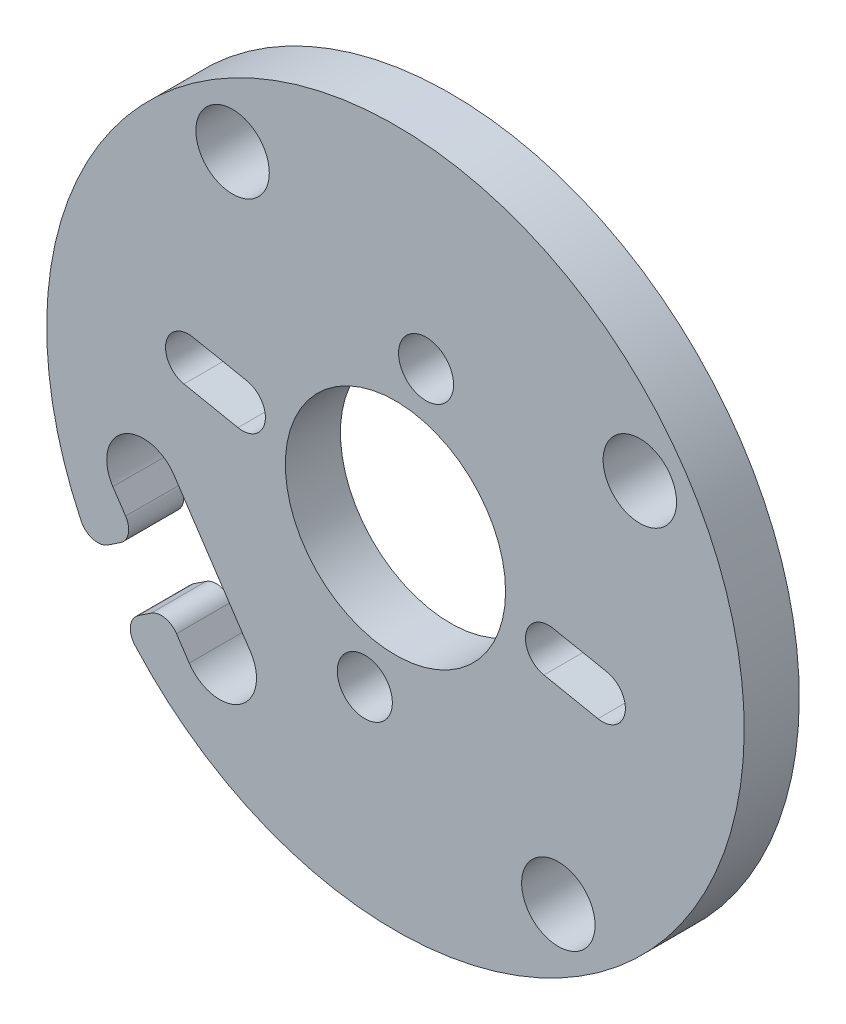
ISO-10303-21;
HEADER;
FILE_DESCRIPTION(('STEP AP214'),'2;1');
FILE_NAME('part.step','',(''),(''),'','','');
FILE_SCHEMA(('AUTOMOTIVE_DESIGN { 1 0 10303 214 1 1 1 1 }'));
ENDSEC;
DATA;
#1=APPLICATION_CONTEXT('core data for automotive mechanical design processes');
#2=APPLICATION_PROTOCOL_DEFINITION('international standard','automotive_design',2000,#1);
#3=PRODUCT_CONTEXT('',#1,'mechanical');
#4=PRODUCT('Part','Part','',(#3));
#5=PRODUCT_RELATED_PRODUCT_CATEGORY('part','',(#4));
#6=PRODUCT_DEFINITION_FORMATION('','',#4);
#7=PRODUCT_DEFINITION_CONTEXT('part definition',#1,'design');
#8=PRODUCT_DEFINITION('design','',#6,#7);
#9=PRODUCT_DEFINITION_SHAPE('','',#8);
#10=(LENGTH_UNIT() NAMED_UNIT(*) SI_UNIT(.MILLI.,.METRE.));
#11=(NAMED_UNIT(*) PLANE_ANGLE_UNIT() SI_UNIT($,.RADIAN.));
#12=(NAMED_UNIT(*) SI_UNIT($,.STERADIAN.) SOLID_ANGLE_UNIT());
#13=UNCERTAINTY_MEASURE_WITH_UNIT(LENGTH_MEASURE(1.E-05),#10,'distance_accuracy_value','');
#14=(GEOMETRIC_REPRESENTATION_CONTEXT(3) GLOBAL_UNCERTAINTY_ASSIGNED_CONTEXT((#13)) GLOBAL_UNIT_ASSIGNED_CONTEXT((#10,
#11,#12)) REPRESENTATION_CONTEXT('',''));
#15=CARTESIAN_POINT('',(0.,0.,0.));
#16=DIRECTION('',(0.,0.,1.));
#17=DIRECTION('',(1.,0.,0.));
#18=AXIS2_PLACEMENT_3D('',#15,#16,#17);
#19=CARTESIAN_POINT('',(-13.7294038679801,-4.64391746587856,3.));
#20=DIRECTION('',(0.,0.,1.));
#21=DIRECTION('',(1.,0.,0.));
#22=AXIS2_PLACEMENT_3D('',#19,#20,#21);
#23=PLANE('',#22);
#24=DIRECTION('',(0.980556431696109,-0.196237316174562,0.));
#25=VECTOR('',#24,1.);
#26=CARTESIAN_POINT('',(-11.5216956097235,1.03103359638733,3.));
#27=LINE('',#26,#25);
#28=CARTESIAN_POINT('',(-11.5216956097235,1.03103359638733,3.));
#29=VERTEX_POINT('',#28);
#30=CARTESIAN_POINT('',(-8.58002631463512,0.442321647863641,3.));
#31=VERTEX_POINT('',#30);
#32=EDGE_CURVE('E207',#29,#31,#27,.T.);
#33=ORIENTED_EDGE('',*,*,#32,.F.);
#34=CARTESIAN_POINT('',(-11.2763989645052,2.25672913600746,3.));
#35=DIRECTION('',(0.,0.,1.));
#36=DIRECTION('',(1.,0.,0.));
#37=AXIS2_PLACEMENT_3D('',#34,#35,#36);
#38=CIRCLE('',#37,1.25);
#39=CARTESIAN_POINT('',(-11.031102319287,3.4824246756276,3.));
#40=VERTEX_POINT('',#39);
#41=EDGE_CURVE('E205',#40,#29,#38,.T.);
#42=ORIENTED_EDGE('',*,*,#41,.F.);
#43=DIRECTION('',(-0.980556431696109,0.196237316174562,0.));
#44=VECTOR('',#43,1.);
#45=CARTESIAN_POINT('',(-11.031102319287,3.4824246756276,3.));
#46=LINE('',#45,#44);
#47=CARTESIAN_POINT('',(-8.08943302419872,2.89371272710391,3.));
#48=VERTEX_POINT('',#47);
#49=EDGE_CURVE('E213',#48,#40,#46,.T.);
#50=ORIENTED_EDGE('',*,*,#49,.F.);
#51=CARTESIAN_POINT('',(-8.33472966941692,1.66801718748378,3.));
#52=DIRECTION('',(0.,0.,1.));
#53=DIRECTION('',(1.,0.,0.));
#54=AXIS2_PLACEMENT_3D('',#51,#52,#53);
#55=CIRCLE('',#54,1.25);
#56=EDGE_CURVE('E210',#31,#48,#55,.T.);
#57=ORIENTED_EDGE('',*,*,#56,.F.);
#58=EDGE_LOOP('',(#33,#42,#50,#57));
#59=FACE_BOUND('',#58,.T.);
#60=CARTESIAN_POINT('',(8.87355781395305,-13.3139013829657,3.));
#61=DIRECTION('',(0.,0.,1.));
#62=DIRECTION('',(1.,0.,0.));
#63=AXIS2_PLACEMENT_3D('',#60,#61,#62);
#64=CIRCLE('',#63,2.);
#65=CARTESIAN_POINT('',(10.8735578139531,-13.3139013829657,3.));
#66=VERTEX_POINT('',#65);
#67=EDGE_CURVE('E242',#66,#66,#64,.T.);
#68=ORIENTED_EDGE('',*,*,#67,.F.);
#69=EDGE_LOOP('',(#68));
#70=FACE_BOUND('',#69,.T.);
#71=CARTESIAN_POINT('',(1.66801718748375,8.33472966941693,3.));
#72=DIRECTION('',(0.,0.,1.));
#73=DIRECTION('',(1.,0.,0.));
#74=AXIS2_PLACEMENT_3D('',#71,#72,#73);
#75=CIRCLE('',#74,1.5);
#76=CARTESIAN_POINT('',(3.16801718748375,8.33472966941693,3.));
#77=VERTEX_POINT('',#76);
#78=EDGE_CURVE('E254',#77,#77,#75,.T.);
#79=ORIENTED_EDGE('',*,*,#78,.F.);
#80=EDGE_LOOP('',(#79));
#81=FACE_BOUND('',#80,.T.);
#82=CARTESIAN_POINT('',(-8.8735578431924,13.3139014268365,3.));
#83=DIRECTION('',(0.,0.,1.));
#84=DIRECTION('',(1.,0.,0.));
#85=AXIS2_PLACEMENT_3D('',#82,#83,#84);
#86=CIRCLE('',#85,2.);
#87=CARTESIAN_POINT('',(-6.87355784319241,13.3139014268365,3.));
#88=VERTEX_POINT('',#87);
#89=EDGE_CURVE('E266',#88,#88,#86,.T.);
#90=ORIENTED_EDGE('',*,*,#89,.F.);
#91=EDGE_LOOP('',(#90));
#92=FACE_BOUND('',#91,.T.);
#93=CARTESIAN_POINT('',(-13.7294038679801,-4.64391746587856,3.));
#94=DIRECTION('',(0.,0.,-1.));
#95=DIRECTION('',(1.,0.,0.));
#96=AXIS2_PLACEMENT_3D('',#93,#94,#95);
#97=CIRCLE('',#96,2.);
#98=CARTESIAN_POINT('',(-15.3936415463347,-5.7531121962776,3.));
#99=VERTEX_POINT('',#98);
#100=CARTESIAN_POINT('',(-12.0651661896256,-3.5347227354795,3.));
#101=VERTEX_POINT('',#100);
#102=EDGE_CURVE('E272',#99,#101,#97,.T.);
#103=ORIENTED_EDGE('',*,*,#102,.T.);
#104=DIRECTION('',(0.554597365199526,-0.83211883917728,0.));
#105=VECTOR('',#104,1.);
#106=CARTESIAN_POINT('',(-12.0651661896256,-3.5347227354795,3.));
#107=LINE('',#106,#105);
#108=CARTESIAN_POINT('',(-7.90568595062914,-9.77561402930911,3.));
#109=VERTEX_POINT('',#108);
#110=EDGE_CURVE('E275',#101,#109,#107,.T.);
#111=ORIENTED_EDGE('',*,*,#110,.T.);
#112=CARTESIAN_POINT('',(-9.5699236289837,-10.8848087597082,3.));
#113=DIRECTION('',(0.,0.,-1.));
#114=DIRECTION('',(1.,0.,0.));
#115=AXIS2_PLACEMENT_3D('',#112,#113,#114);
#116=CIRCLE('',#115,2.);
#117=CARTESIAN_POINT('',(-11.2341613073383,-11.9940034901072,3.));
#118=VERTEX_POINT('',#117);
#119=EDGE_CURVE('E278',#109,#118,#116,.T.);
#120=ORIENTED_EDGE('',*,*,#119,.T.);
#121=DIRECTION('',(-0.554597365199527,0.832118839177279,0.));
#122=VECTOR('',#121,1.);
#123=CARTESIAN_POINT('',(-11.9274080138377,-10.9538549411356,3.));
#124=LINE('',#123,#122);
#125=CARTESIAN_POINT('',(-11.9274080138377,-10.9538549411356,3.));
#126=VERTEX_POINT('',#125);
#127=EDGE_CURVE('E280',#118,#126,#124,.T.);
#128=ORIENTED_EDGE('',*,*,#127,.T.);
#129=CARTESIAN_POINT('',(-12.7595268530149,-11.5084523063351,3.));
#130=DIRECTION('',(0.,0.,1.));
#131=DIRECTION('',(1.,0.,0.));
#132=AXIS2_PLACEMENT_3D('',#129,#130,#131);
#133=CIRCLE('',#132,1.);
#134=CARTESIAN_POINT('',(-13.3141242182145,-10.6763334671579,3.));
#135=VERTEX_POINT('',#134);
#136=EDGE_CURVE('E282',#126,#135,#133,.T.);
#137=ORIENTED_EDGE('',*,*,#136,.T.);
#138=DIRECTION('',(-0.83211883917728,-0.554597365199525,0.));
#139=VECTOR('',#138,1.);
#140=CARTESIAN_POINT('',(-14.0010744921412,-11.1341777004641,3.));
#141=LINE('',#140,#139);
#142=CARTESIAN_POINT('',(-14.0010744921412,-11.1341777004641,3.));
#143=VERTEX_POINT('',#142);
#144=EDGE_CURVE('E284',#135,#143,#141,.T.);
#145=ORIENTED_EDGE('',*,*,#144,.T.);
#146=CARTESIAN_POINT('',(-13.4464771269417,-11.9662965396414,3.));
#147=DIRECTION('',(0.,0.,1.));
#148=DIRECTION('',(-1.,0.,0.));
#149=AXIS2_PLACEMENT_3D('',#146,#147,#148);
#150=CIRCLE('',#149,1.);
#151=CARTESIAN_POINT('',(-14.193503633994,-12.6310907918437,3.));
#152=VERTEX_POINT('',#151);
#153=EDGE_CURVE('E286',#143,#152,#150,.T.);
#154=ORIENTED_EDGE('',*,*,#153,.T.);
#155=CARTESIAN_POINT('',(0.,0.,3.));
#156=DIRECTION('',(0.,0.,1.));
#157=DIRECTION('',(1.,0.,0.));
#158=AXIS2_PLACEMENT_3D('',#155,#156,#157);
#159=CIRCLE('',#158,19.);
#160=CARTESIAN_POINT('',(-17.1205452836581,-8.23935247396365,3.));
#161=VERTEX_POINT('',#160);
#162=EDGE_CURVE('E288',#152,#161,#159,.T.);
#163=ORIENTED_EDGE('',*,*,#162,.T.);
#164=CARTESIAN_POINT('',(-16.2194639529393,-7.80570234375503,3.));
#165=DIRECTION('',(0.,0.,1.));
#166=DIRECTION('',(1.,0.,0.));
#167=AXIS2_PLACEMENT_3D('',#164,#165,#166);
#168=CIRCLE('',#167,1.);
#169=CARTESIAN_POINT('',(-15.6648665877398,-8.63782118293231,3.));
#170=VERTEX_POINT('',#169);
#171=EDGE_CURVE('E290',#161,#170,#168,.T.);
#172=ORIENTED_EDGE('',*,*,#171,.T.);
#173=DIRECTION('',(0.83211883917728,0.554597365199525,0.));
#174=VECTOR('',#173,1.);
#175=CARTESIAN_POINT('',(-14.9779163138131,-8.17997694962601,3.));
#176=LINE('',#175,#174);
#177=CARTESIAN_POINT('',(-14.9779163138131,-8.17997694962601,3.));
#178=VERTEX_POINT('',#177);
#179=EDGE_CURVE('E292',#170,#178,#176,.T.);
#180=ORIENTED_EDGE('',*,*,#179,.T.);
#181=CARTESIAN_POINT('',(-15.5325136790126,-7.34785811044873,3.));
#182=DIRECTION('',(0.,0.,1.));
#183=DIRECTION('',(1.,0.,0.));
#184=AXIS2_PLACEMENT_3D('',#181,#182,#183);
#185=CIRCLE('',#184,0.999999999999997);
#186=CARTESIAN_POINT('',(-14.7003948398353,-6.79326074524921,3.));
#187=VERTEX_POINT('',#186);
#188=EDGE_CURVE('E294',#178,#187,#185,.T.);
#189=ORIENTED_EDGE('',*,*,#188,.T.);
#190=DIRECTION('',(-0.554597365199523,0.832118839177282,0.));
#191=VECTOR('',#190,1.);
#192=CARTESIAN_POINT('',(-15.3936415463347,-5.7531121962776,3.));
#193=LINE('',#192,#191);
#194=EDGE_CURVE('E296',#187,#99,#193,.T.);
#195=ORIENTED_EDGE('',*,*,#194,.T.);
#196=EDGE_LOOP('',(#103,#111,#120,#128,#137,#145,#154,#163,#172,#180,#189,#195));
#197=FACE_BOUND('',#196,.T.);
#198=CARTESIAN_POINT('',(0.,0.,3.));
#199=DIRECTION('',(0.,0.,1.));
#200=DIRECTION('',(1.,0.,0.));
#201=AXIS2_PLACEMENT_3D('',#198,#199,#200);
#202=CIRCLE('',#201,6.);
#203=CARTESIAN_POINT('',(6.,0.,3.));
#204=VERTEX_POINT('',#203);
#205=EDGE_CURVE('E260',#204,#204,#202,.T.);
#206=ORIENTED_EDGE('',*,*,#205,.F.);
#207=EDGE_LOOP('',(#206));
#208=FACE_BOUND('',#207,.T.);
#209=CARTESIAN_POINT('',(13.3139013902814,8.87355785050812,3.));
#210=DIRECTION('',(0.,0.,1.));
#211=DIRECTION('',(1.,0.,0.));
#212=AXIS2_PLACEMENT_3D('',#209,#210,#211);
#213=CIRCLE('',#212,2.);
#214=CARTESIAN_POINT('',(15.3139013902814,8.87355785050812,3.));
#215=VERTEX_POINT('',#214);
#216=EDGE_CURVE('E248',#215,#215,#213,.T.);
#217=ORIENTED_EDGE('',*,*,#216,.F.);
#218=EDGE_LOOP('',(#217));
#219=FACE_BOUND('',#218,.T.);
#220=CARTESIAN_POINT('',(-1.66801718748376,-8.33472966941661,3.));
#221=DIRECTION('',(0.,0.,1.));
#222=DIRECTION('',(1.,0.,0.));
#223=AXIS2_PLACEMENT_3D('',#220,#221,#222);
#224=CIRCLE('',#223,1.5);
#225=CARTESIAN_POINT('',(-0.168017187483764,-8.33472966941661,3.));
#226=VERTEX_POINT('',#225);
#227=EDGE_CURVE('E236',#226,#226,#224,.T.);
#228=ORIENTED_EDGE('',*,*,#227,.F.);
#229=EDGE_LOOP('',(#228));
#230=FACE_BOUND('',#229,.T.);
#231=DIRECTION('',(-0.980540641594783,0.196316199486675,0.));
#232=VECTOR('',#231,1.);
#233=CARTESIAN_POINT('',(11.5216043090981,-1.03200204056394,3.));
#234=LINE('',#233,#232);
#235=CARTESIAN_POINT('',(11.5216043090981,-1.03200204056394,3.));
#236=VERTEX_POINT('',#235);
#237=CARTESIAN_POINT('',(8.57998238431369,-0.443053442103907,3.));
#238=VERTEX_POINT('',#237);
#239=EDGE_CURVE('E177',#236,#238,#234,.T.);
#240=ORIENTED_EDGE('',*,*,#239,.F.);
#241=CARTESIAN_POINT('',(11.2762090597397,-2.25767784255741,3.));
#242=DIRECTION('',(0.,0.,1.));
#243=DIRECTION('',(1.,0.,0.));
#244=AXIS2_PLACEMENT_3D('',#241,#242,#243);
#245=CIRCLE('',#244,1.24999999999999);
#246=CARTESIAN_POINT('',(11.0308138103814,-3.48335364455089,3.));
#247=VERTEX_POINT('',#246);
#248=EDGE_CURVE('E169',#247,#236,#245,.T.);
#249=ORIENTED_EDGE('',*,*,#248,.F.);
#250=DIRECTION('',(0.980540641594783,-0.196316199486675,0.));
#251=VECTOR('',#250,1.);
#252=CARTESIAN_POINT('',(11.0308138103814,-3.48335364455089,3.));
#253=LINE('',#252,#251);
#254=CARTESIAN_POINT('',(8.08919188559701,-2.89440504609086,3.));
#255=VERTEX_POINT('',#254);
#256=EDGE_CURVE('E191',#255,#247,#253,.T.);
#257=ORIENTED_EDGE('',*,*,#256,.F.);
#258=CARTESIAN_POINT('',(8.33458713495535,-1.66872924409738,3.));
#259=DIRECTION('',(0.,0.,1.));
#260=DIRECTION('',(1.,0.,0.));
#261=AXIS2_PLACEMENT_3D('',#258,#259,#260);
#262=CIRCLE('',#261,1.24999999999999);
#263=EDGE_CURVE('E189',#238,#255,#262,.T.);
#264=ORIENTED_EDGE('',*,*,#263,.F.);
#265=EDGE_LOOP('',(#240,#249,#257,#264));
#266=FACE_BOUND('',#265,.T.);
#267=ADVANCED_FACE('F32',(#59,#70,#81,#92,#197,#208,#219,#230,#266),#23,.T.);
#268=CARTESIAN_POINT('',(-13.7294038679801,-4.64391746587856,0.));
#269=DIRECTION('',(0.,0.,1.));
#270=DIRECTION('',(1.,0.,0.));
#271=AXIS2_PLACEMENT_3D('',#268,#269,#270);
#272=PLANE('',#271);
#273=CARTESIAN_POINT('',(-11.2763989645052,2.25672913600746,0.));
#274=DIRECTION('',(0.,0.,1.));
#275=DIRECTION('',(1.,0.,0.));
#276=AXIS2_PLACEMENT_3D('',#273,#274,#275);
#277=CIRCLE('',#276,1.25);
#278=CARTESIAN_POINT('',(-11.031102319287,3.4824246756276,0.));
#279=VERTEX_POINT('',#278);
#280=CARTESIAN_POINT('',(-11.5216956097235,1.03103359638733,0.));
#281=VERTEX_POINT('',#280);
#282=EDGE_CURVE('E185',#279,#281,#277,.T.);
#283=ORIENTED_EDGE('',*,*,#282,.T.);
#284=DIRECTION('',(0.980556431696109,-0.196237316174562,0.));
#285=VECTOR('',#284,1.);
#286=CARTESIAN_POINT('',(-11.5216956097235,1.03103359638733,0.));
#287=LINE('',#286,#285);
#288=CARTESIAN_POINT('',(-8.58002631463512,0.442321647863641,0.));
#289=VERTEX_POINT('',#288);
#290=EDGE_CURVE('E218',#281,#289,#287,.T.);
#291=ORIENTED_EDGE('',*,*,#290,.T.);
#292=CARTESIAN_POINT('',(-8.33472966941692,1.66801718748378,0.));
#293=DIRECTION('',(0.,0.,1.));
#294=DIRECTION('',(1.,0.,0.));
#295=AXIS2_PLACEMENT_3D('',#292,#293,#294);
#296=CIRCLE('',#295,1.25);
#297=CARTESIAN_POINT('',(-8.08943302419872,2.89371272710391,0.));
#298=VERTEX_POINT('',#297);
#299=EDGE_CURVE('E221',#289,#298,#296,.T.);
#300=ORIENTED_EDGE('',*,*,#299,.T.);
#301=DIRECTION('',(-0.980556431696109,0.196237316174562,0.));
#302=VECTOR('',#301,1.);
#303=CARTESIAN_POINT('',(-11.031102319287,3.4824246756276,0.));
#304=LINE('',#303,#302);
#305=EDGE_CURVE('E208',#298,#279,#304,.T.);
#306=ORIENTED_EDGE('',*,*,#305,.T.);
#307=EDGE_LOOP('',(#283,#291,#300,#306));
#308=FACE_BOUND('',#307,.T.);
#309=CARTESIAN_POINT('',(8.87355781395305,-13.3139013829657,0.));
#310=DIRECTION('',(0.,0.,1.));
#311=DIRECTION('',(1.,0.,0.));
#312=AXIS2_PLACEMENT_3D('',#309,#310,#311);
#313=CIRCLE('',#312,2.);
#314=CARTESIAN_POINT('',(10.8735578139531,-13.3139013829657,0.));
#315=VERTEX_POINT('',#314);
#316=EDGE_CURVE('E239',#315,#315,#313,.T.);
#317=ORIENTED_EDGE('',*,*,#316,.T.);
#318=EDGE_LOOP('',(#317));
#319=FACE_BOUND('',#318,.T.);
#320=CARTESIAN_POINT('',(1.66801718748375,8.33472966941693,0.));
#321=DIRECTION('',(0.,0.,1.));
#322=DIRECTION('',(1.,0.,0.));
#323=AXIS2_PLACEMENT_3D('',#320,#321,#322);
#324=CIRCLE('',#323,1.5);
#325=CARTESIAN_POINT('',(3.16801718748375,8.33472966941693,0.));
#326=VERTEX_POINT('',#325);
#327=EDGE_CURVE('E251',#326,#326,#324,.T.);
#328=ORIENTED_EDGE('',*,*,#327,.T.);
#329=EDGE_LOOP('',(#328));
#330=FACE_BOUND('',#329,.T.);
#331=CARTESIAN_POINT('',(-8.8735578431924,13.3139014268365,0.));
#332=DIRECTION('',(0.,0.,1.));
#333=DIRECTION('',(1.,0.,0.));
#334=AXIS2_PLACEMENT_3D('',#331,#332,#333);
#335=CIRCLE('',#334,2.);
#336=CARTESIAN_POINT('',(-6.87355784319241,13.3139014268365,0.));
#337=VERTEX_POINT('',#336);
#338=EDGE_CURVE('E263',#337,#337,#335,.T.);
#339=ORIENTED_EDGE('',*,*,#338,.T.);
#340=EDGE_LOOP('',(#339));
#341=FACE_BOUND('',#340,.T.);
#342=CARTESIAN_POINT('',(-13.7294038679801,-4.64391746587856,0.));
#343=DIRECTION('',(0.,0.,-1.));
#344=DIRECTION('',(1.,0.,0.));
#345=AXIS2_PLACEMENT_3D('',#342,#343,#344);
#346=CIRCLE('',#345,2.);
#347=CARTESIAN_POINT('',(-15.3936415463347,-5.7531121962776,0.));
#348=VERTEX_POINT('',#347);
#349=CARTESIAN_POINT('',(-12.0651661896256,-3.5347227354795,0.));
#350=VERTEX_POINT('',#349);
#351=EDGE_CURVE('E269',#348,#350,#346,.T.);
#352=ORIENTED_EDGE('',*,*,#351,.F.);
#353=DIRECTION('',(-0.554597365199523,0.832118839177282,0.));
#354=VECTOR('',#353,1.);
#355=CARTESIAN_POINT('',(-15.3936415463347,-5.7531121962776,0.));
#356=LINE('',#355,#354);
#357=CARTESIAN_POINT('',(-14.7003948398353,-6.79326074524921,0.));
#358=VERTEX_POINT('',#357);
#359=EDGE_CURVE('E276',#358,#348,#356,.T.);
#360=ORIENTED_EDGE('',*,*,#359,.F.);
#361=CARTESIAN_POINT('',(-15.5325136790126,-7.34785811044873,0.));
#362=DIRECTION('',(0.,0.,1.));
#363=DIRECTION('',(1.,0.,0.));
#364=AXIS2_PLACEMENT_3D('',#361,#362,#363);
#365=CIRCLE('',#364,0.999999999999997);
#366=CARTESIAN_POINT('',(-14.9779163138131,-8.17997694962601,0.));
#367=VERTEX_POINT('',#366);
#368=EDGE_CURVE('E319',#367,#358,#365,.T.);
#369=ORIENTED_EDGE('',*,*,#368,.F.);
#370=DIRECTION('',(0.83211883917728,0.554597365199525,0.));
#371=VECTOR('',#370,1.);
#372=CARTESIAN_POINT('',(-14.9779163138131,-8.17997694962601,0.));
#373=LINE('',#372,#371);
#374=CARTESIAN_POINT('',(-15.6648665877398,-8.63782118293231,0.));
#375=VERTEX_POINT('',#374);
#376=EDGE_CURVE('E317',#375,#367,#373,.T.);
#377=ORIENTED_EDGE('',*,*,#376,.F.);
#378=CARTESIAN_POINT('',(-16.2194639529393,-7.80570234375503,0.));
#379=DIRECTION('',(0.,0.,1.));
#380=DIRECTION('',(1.,0.,0.));
#381=AXIS2_PLACEMENT_3D('',#378,#379,#380);
#382=CIRCLE('',#381,1.);
#383=CARTESIAN_POINT('',(-17.1205452836581,-8.23935247396365,0.));
#384=VERTEX_POINT('',#383);
#385=EDGE_CURVE('E315',#384,#375,#382,.T.);
#386=ORIENTED_EDGE('',*,*,#385,.F.);
#387=CARTESIAN_POINT('',(0.,0.,0.));
#388=DIRECTION('',(0.,0.,1.));
#389=DIRECTION('',(1.,0.,0.));
#390=AXIS2_PLACEMENT_3D('',#387,#388,#389);
#391=CIRCLE('',#390,19.);
#392=CARTESIAN_POINT('',(-14.193503633994,-12.6310907918437,0.));
#393=VERTEX_POINT('',#392);
#394=EDGE_CURVE('E313',#393,#384,#391,.T.);
#395=ORIENTED_EDGE('',*,*,#394,.F.);
#396=CARTESIAN_POINT('',(-13.4464771269417,-11.9662965396414,0.));
#397=DIRECTION('',(0.,0.,1.));
#398=DIRECTION('',(-1.,0.,0.));
#399=AXIS2_PLACEMENT_3D('',#396,#397,#398);
#400=CIRCLE('',#399,1.);
#401=CARTESIAN_POINT('',(-14.0010744921412,-11.1341777004641,0.));
#402=VERTEX_POINT('',#401);
#403=EDGE_CURVE('E311',#402,#393,#400,.T.);
#404=ORIENTED_EDGE('',*,*,#403,.F.);
#405=DIRECTION('',(-0.83211883917728,-0.554597365199525,0.));
#406=VECTOR('',#405,1.);
#407=CARTESIAN_POINT('',(-14.0010744921412,-11.1341777004641,0.));
#408=LINE('',#407,#406);
#409=CARTESIAN_POINT('',(-13.3141242182145,-10.6763334671579,0.));
#410=VERTEX_POINT('',#409);
#411=EDGE_CURVE('E309',#410,#402,#408,.T.);
#412=ORIENTED_EDGE('',*,*,#411,.F.);
#413=CARTESIAN_POINT('',(-12.7595268530149,-11.5084523063351,0.));
#414=DIRECTION('',(0.,0.,1.));
#415=DIRECTION('',(1.,0.,0.));
#416=AXIS2_PLACEMENT_3D('',#413,#414,#415);
#417=CIRCLE('',#416,1.);
#418=CARTESIAN_POINT('',(-11.9274080138377,-10.9538549411356,0.));
#419=VERTEX_POINT('',#418);
#420=EDGE_CURVE('E307',#419,#410,#417,.T.);
#421=ORIENTED_EDGE('',*,*,#420,.F.);
#422=DIRECTION('',(-0.554597365199527,0.832118839177279,0.));
#423=VECTOR('',#422,1.);
#424=CARTESIAN_POINT('',(-11.9274080138377,-10.9538549411356,0.));
#425=LINE('',#424,#423);
#426=CARTESIAN_POINT('',(-11.2341613073383,-11.9940034901072,0.));
#427=VERTEX_POINT('',#426);
#428=EDGE_CURVE('E305',#427,#419,#425,.T.);
#429=ORIENTED_EDGE('',*,*,#428,.F.);
#430=CARTESIAN_POINT('',(-9.5699236289837,-10.8848087597082,0.));
#431=DIRECTION('',(0.,0.,-1.));
#432=DIRECTION('',(1.,0.,0.));
#433=AXIS2_PLACEMENT_3D('',#430,#431,#432);
#434=CIRCLE('',#433,2.);
#435=CARTESIAN_POINT('',(-7.90568595062914,-9.77561402930911,0.));
#436=VERTEX_POINT('',#435);
#437=EDGE_CURVE('E303',#436,#427,#434,.T.);
#438=ORIENTED_EDGE('',*,*,#437,.F.);
#439=DIRECTION('',(0.554597365199526,-0.83211883917728,0.));
#440=VECTOR('',#439,1.);
#441=CARTESIAN_POINT('',(-12.0651661896256,-3.5347227354795,0.));
#442=LINE('',#441,#440);
#443=EDGE_CURVE('E301',#350,#436,#442,.T.);
#444=ORIENTED_EDGE('',*,*,#443,.F.);
#445=EDGE_LOOP('',(#352,#360,#369,#377,#386,#395,#404,#412,#421,#429,#438,#444));
#446=FACE_BOUND('',#445,.T.);
#447=CARTESIAN_POINT('',(0.,0.,0.));
#448=DIRECTION('',(0.,0.,1.));
#449=DIRECTION('',(1.,0.,0.));
#450=AXIS2_PLACEMENT_3D('',#447,#448,#449);
#451=CIRCLE('',#450,6.);
#452=CARTESIAN_POINT('',(6.,0.,0.));
#453=VERTEX_POINT('',#452);
#454=EDGE_CURVE('E257',#453,#453,#451,.T.);
#455=ORIENTED_EDGE('',*,*,#454,.T.);
#456=EDGE_LOOP('',(#455));
#457=FACE_BOUND('',#456,.T.);
#458=CARTESIAN_POINT('',(13.3139013902814,8.87355785050812,0.));
#459=DIRECTION('',(0.,0.,1.));
#460=DIRECTION('',(1.,0.,0.));
#461=AXIS2_PLACEMENT_3D('',#458,#459,#460);
#462=CIRCLE('',#461,2.);
#463=CARTESIAN_POINT('',(15.3139013902814,8.87355785050812,0.));
#464=VERTEX_POINT('',#463);
#465=EDGE_CURVE('E245',#464,#464,#462,.T.);
#466=ORIENTED_EDGE('',*,*,#465,.T.);
#467=EDGE_LOOP('',(#466));
#468=FACE_BOUND('',#467,.T.);
#469=CARTESIAN_POINT('',(-1.66801718748376,-8.33472966941661,0.));
#470=DIRECTION('',(0.,0.,1.));
#471=DIRECTION('',(1.,0.,0.));
#472=AXIS2_PLACEMENT_3D('',#469,#470,#471);
#473=CIRCLE('',#472,1.5);
#474=CARTESIAN_POINT('',(-0.168017187483764,-8.33472966941661,0.));
#475=VERTEX_POINT('',#474);
#476=EDGE_CURVE('E235',#475,#475,#473,.T.);
#477=ORIENTED_EDGE('',*,*,#476,.T.);
#478=EDGE_LOOP('',(#477));
#479=FACE_BOUND('',#478,.T.);
#480=CARTESIAN_POINT('',(11.2762090597397,-2.25767784255741,0.));
#481=DIRECTION('',(0.,0.,1.));
#482=DIRECTION('',(1.,0.,0.));
#483=AXIS2_PLACEMENT_3D('',#480,#481,#482);
#484=CIRCLE('',#483,1.24999999999999);
#485=CARTESIAN_POINT('',(11.0308138103814,-3.48335364455089,0.));
#486=VERTEX_POINT('',#485);
#487=CARTESIAN_POINT('',(11.5216043090981,-1.03200204056394,0.));
#488=VERTEX_POINT('',#487);
#489=EDGE_CURVE('E55',#486,#488,#484,.T.);
#490=ORIENTED_EDGE('',*,*,#489,.T.);
#491=DIRECTION('',(-0.980540641594783,0.196316199486675,0.));
#492=VECTOR('',#491,1.);
#493=CARTESIAN_POINT('',(11.5216043090981,-1.03200204056394,0.));
#494=LINE('',#493,#492);
#495=CARTESIAN_POINT('',(8.57998238431369,-0.443053442103907,0.));
#496=VERTEX_POINT('',#495);
#497=EDGE_CURVE('E184',#488,#496,#494,.T.);
#498=ORIENTED_EDGE('',*,*,#497,.T.);
#499=CARTESIAN_POINT('',(8.33458713495535,-1.66872924409738,0.));
#500=DIRECTION('',(0.,0.,1.));
#501=DIRECTION('',(1.,0.,0.));
#502=AXIS2_PLACEMENT_3D('',#499,#500,#501);
#503=CIRCLE('',#502,1.24999999999999);
#504=CARTESIAN_POINT('',(8.08919188559701,-2.89440504609086,0.));
#505=VERTEX_POINT('',#504);
#506=EDGE_CURVE('E197',#496,#505,#503,.T.);
#507=ORIENTED_EDGE('',*,*,#506,.T.);
#508=DIRECTION('',(0.980540641594783,-0.196316199486675,0.));
#509=VECTOR('',#508,1.);
#510=CARTESIAN_POINT('',(11.0308138103814,-3.48335364455089,0.));
#511=LINE('',#510,#509);
#512=EDGE_CURVE('E178',#505,#486,#511,.T.);
#513=ORIENTED_EDGE('',*,*,#512,.T.);
#514=EDGE_LOOP('',(#490,#498,#507,#513));
#515=FACE_BOUND('',#514,.T.);
#516=ADVANCED_FACE('F361',(#308,#319,#330,#341,#446,#457,#468,#479,#515),#272,.F.);
#517=CARTESIAN_POINT('',(-13.7294038679801,-4.64391746587856,3.));
#518=DIRECTION('',(0.,0.,-1.));
#519=DIRECTION('',(-1.,0.,0.));
#520=AXIS2_PLACEMENT_3D('',#517,#518,#519);
#521=CYLINDRICAL_SURFACE('',#520,2.);
#522=ORIENTED_EDGE('',*,*,#351,.T.);
#523=DIRECTION('',(0.,0.,-1.));
#524=VECTOR('',#523,1.);
#525=CARTESIAN_POINT('',(-12.0651661896256,-3.5347227354795,3.));
#526=LINE('',#525,#524);
#527=EDGE_CURVE('E11',#101,#350,#526,.T.);
#528=ORIENTED_EDGE('',*,*,#527,.F.);
#529=ORIENTED_EDGE('',*,*,#102,.F.);
#530=DIRECTION('',(0.,0.,-1.));
#531=VECTOR('',#530,1.);
#532=CARTESIAN_POINT('',(-15.3936415463347,-5.7531121962776,3.));
#533=LINE('',#532,#531);
#534=EDGE_CURVE('E298',#99,#348,#533,.T.);
#535=ORIENTED_EDGE('',*,*,#534,.T.);
#536=EDGE_LOOP('',(#522,#528,#529,#535));
#537=FACE_BOUND('',#536,.T.);
#538=ADVANCED_FACE('F34',(#537),#521,.F.);
#539=CARTESIAN_POINT('',(-12.0651661896256,-3.5347227354795,3.));
#540=DIRECTION('',(0.83211883917728,0.554597365199526,0.));
#541=DIRECTION('',(-0.554597365199526,0.83211883917728,0.));
#542=AXIS2_PLACEMENT_3D('',#539,#540,#541);
#543=PLANE('',#542);
#544=ORIENTED_EDGE('',*,*,#443,.T.);
#545=DIRECTION('',(0.,0.,-1.));
#546=VECTOR('',#545,1.);
#547=CARTESIAN_POINT('',(-7.90568595062914,-9.77561402930911,3.));
#548=LINE('',#547,#546);
#549=EDGE_CURVE('E40',#109,#436,#548,.T.);
#550=ORIENTED_EDGE('',*,*,#549,.F.);
#551=ORIENTED_EDGE('',*,*,#110,.F.);
#552=ORIENTED_EDGE('',*,*,#527,.T.);
#553=EDGE_LOOP('',(#544,#550,#551,#552));
#554=FACE_BOUND('',#553,.T.);
#555=ADVANCED_FACE('F379',(#554),#543,.F.);
#556=CARTESIAN_POINT('',(-9.5699236289837,-10.8848087597082,3.));
#557=DIRECTION('',(0.,0.,-1.));
#558=DIRECTION('',(-1.,0.,0.));
#559=AXIS2_PLACEMENT_3D('',#556,#557,#558);
#560=CYLINDRICAL_SURFACE('',#559,2.);
#561=ORIENTED_EDGE('',*,*,#437,.T.);
#562=DIRECTION('',(0.,0.,-1.));
#563=VECTOR('',#562,1.);
#564=CARTESIAN_POINT('',(-11.2341613073383,-11.9940034901072,3.));
#565=LINE('',#564,#563);
#566=EDGE_CURVE('E348',#118,#427,#565,.T.);
#567=ORIENTED_EDGE('',*,*,#566,.F.);
#568=ORIENTED_EDGE('',*,*,#119,.F.);
#569=ORIENTED_EDGE('',*,*,#549,.T.);
#570=EDGE_LOOP('',(#561,#567,#568,#569));
#571=FACE_BOUND('',#570,.T.);
#572=ADVANCED_FACE('F355',(#571),#560,.F.);
#573=CARTESIAN_POINT('',(-11.9274080138377,-10.9538549411356,3.));
#574=DIRECTION('',(-0.832118839177279,-0.554597365199527,0.));
#575=DIRECTION('',(0.554597365199527,-0.832118839177279,0.));
#576=AXIS2_PLACEMENT_3D('',#573,#574,#575);
#577=PLANE('',#576);
#578=ORIENTED_EDGE('',*,*,#428,.T.);
#579=DIRECTION('',(0.,0.,-1.));
#580=VECTOR('',#579,1.);
#581=CARTESIAN_POINT('',(-11.9274080138377,-10.9538549411356,3.));
#582=LINE('',#581,#580);
#583=EDGE_CURVE('E345',#126,#419,#582,.T.);
#584=ORIENTED_EDGE('',*,*,#583,.F.);
#585=ORIENTED_EDGE('',*,*,#127,.F.);
#586=ORIENTED_EDGE('',*,*,#566,.T.);
#587=EDGE_LOOP('',(#578,#584,#585,#586));
#588=FACE_BOUND('',#587,.T.);
#589=ADVANCED_FACE('F367',(#588),#577,.F.);
#590=CARTESIAN_POINT('',(-12.7595268530149,-11.5084523063351,3.));
#591=DIRECTION('',(0.,0.,-1.));
#592=DIRECTION('',(-1.,0.,0.));
#593=AXIS2_PLACEMENT_3D('',#590,#591,#592);
#594=CYLINDRICAL_SURFACE('',#593,1.);
#595=ORIENTED_EDGE('',*,*,#420,.T.);
#596=DIRECTION('',(0.,0.,-1.));
#597=VECTOR('',#596,1.);
#598=CARTESIAN_POINT('',(-13.3141242182145,-10.6763334671579,3.));
#599=LINE('',#598,#597);
#600=EDGE_CURVE('E342',#135,#410,#599,.T.);
#601=ORIENTED_EDGE('',*,*,#600,.F.);
#602=ORIENTED_EDGE('',*,*,#136,.F.);
#603=ORIENTED_EDGE('',*,*,#583,.T.);
#604=EDGE_LOOP('',(#595,#601,#602,#603));
#605=FACE_BOUND('',#604,.T.);
#606=ADVANCED_FACE('F371',(#605),#594,.T.);
#607=CARTESIAN_POINT('',(-14.0010744921412,-11.1341777004641,3.));
#608=DIRECTION('',(0.554597365199525,-0.83211883917728,0.));
#609=DIRECTION('',(0.83211883917728,0.554597365199525,0.));
#610=AXIS2_PLACEMENT_3D('',#607,#608,#609);
#611=PLANE('',#610);
#612=ORIENTED_EDGE('',*,*,#411,.T.);
#613=DIRECTION('',(0.,0.,-1.));
#614=VECTOR('',#613,1.);
#615=CARTESIAN_POINT('',(-14.0010744921412,-11.1341777004641,3.));
#616=LINE('',#615,#614);
#617=EDGE_CURVE('E339',#143,#402,#616,.T.);
#618=ORIENTED_EDGE('',*,*,#617,.F.);
#619=ORIENTED_EDGE('',*,*,#144,.F.);
#620=ORIENTED_EDGE('',*,*,#600,.T.);
#621=EDGE_LOOP('',(#612,#618,#619,#620));
#622=FACE_BOUND('',#621,.T.);
#623=ADVANCED_FACE('F412',(#622),#611,.F.);
#624=CARTESIAN_POINT('',(-13.4464771269417,-11.9662965396414,3.));
#625=DIRECTION('',(0.,0.,-1.));
#626=DIRECTION('',(-1.,0.,0.));
#627=AXIS2_PLACEMENT_3D('',#624,#625,#626);
#628=CYLINDRICAL_SURFACE('',#627,1.);
#629=ORIENTED_EDGE('',*,*,#403,.T.);
#630=DIRECTION('',(0.,0.,-1.));
#631=VECTOR('',#630,1.);
#632=CARTESIAN_POINT('',(-14.193503633994,-12.6310907918437,3.));
#633=LINE('',#632,#631);
#634=EDGE_CURVE('E336',#152,#393,#633,.T.);
#635=ORIENTED_EDGE('',*,*,#634,.F.);
#636=ORIENTED_EDGE('',*,*,#153,.F.);
#637=ORIENTED_EDGE('',*,*,#617,.T.);
#638=EDGE_LOOP('',(#629,#635,#636,#637));
#639=FACE_BOUND('',#638,.T.);
#640=ADVANCED_FACE('F410',(#639),#628,.T.);
#641=CARTESIAN_POINT('',(0.,0.,3.));
#642=DIRECTION('',(0.,0.,-1.));
#643=DIRECTION('',(-1.,0.,0.));
#644=AXIS2_PLACEMENT_3D('',#641,#642,#643);
#645=CYLINDRICAL_SURFACE('',#644,19.);
#646=ORIENTED_EDGE('',*,*,#394,.T.);
#647=DIRECTION('',(0.,0.,-1.));
#648=VECTOR('',#647,1.);
#649=CARTESIAN_POINT('',(-17.1205452836581,-8.23935247396365,3.));
#650=LINE('',#649,#648);
#651=EDGE_CURVE('E333',#161,#384,#650,.T.);
#652=ORIENTED_EDGE('',*,*,#651,.F.);
#653=ORIENTED_EDGE('',*,*,#162,.F.);
#654=ORIENTED_EDGE('',*,*,#634,.T.);
#655=EDGE_LOOP('',(#646,#652,#653,#654));
#656=FACE_BOUND('',#655,.T.);
#657=ADVANCED_FACE('F406',(#656),#645,.T.);
#658=CARTESIAN_POINT('',(-16.2194639529393,-7.80570234375503,3.));
#659=DIRECTION('',(0.,0.,-1.));
#660=DIRECTION('',(-1.,0.,0.));
#661=AXIS2_PLACEMENT_3D('',#658,#659,#660);
#662=CYLINDRICAL_SURFACE('',#661,1.);
#663=ORIENTED_EDGE('',*,*,#385,.T.);
#664=DIRECTION('',(0.,0.,-1.));
#665=VECTOR('',#664,1.);
#666=CARTESIAN_POINT('',(-15.6648665877398,-8.63782118293231,3.));
#667=LINE('',#666,#665);
#668=EDGE_CURVE('E330',#170,#375,#667,.T.);
#669=ORIENTED_EDGE('',*,*,#668,.F.);
#670=ORIENTED_EDGE('',*,*,#171,.F.);
#671=ORIENTED_EDGE('',*,*,#651,.T.);
#672=EDGE_LOOP('',(#663,#669,#670,#671));
#673=FACE_BOUND('',#672,.T.);
#674=ADVANCED_FACE('F401',(#673),#662,.T.);
#675=CARTESIAN_POINT('',(-14.9779163138131,-8.17997694962601,3.));
#676=DIRECTION('',(-0.554597365199525,0.83211883917728,0.));
#677=DIRECTION('',(-0.83211883917728,-0.554597365199525,0.));
#678=AXIS2_PLACEMENT_3D('',#675,#676,#677);
#679=PLANE('',#678);
#680=ORIENTED_EDGE('',*,*,#376,.T.);
#681=DIRECTION('',(0.,0.,-1.));
#682=VECTOR('',#681,1.);
#683=CARTESIAN_POINT('',(-14.9779163138131,-8.17997694962601,3.));
#684=LINE('',#683,#682);
#685=EDGE_CURVE('E327',#178,#367,#684,.T.);
#686=ORIENTED_EDGE('',*,*,#685,.F.);
#687=ORIENTED_EDGE('',*,*,#179,.F.);
#688=ORIENTED_EDGE('',*,*,#668,.T.);
#689=EDGE_LOOP('',(#680,#686,#687,#688));
#690=FACE_BOUND('',#689,.T.);
#691=ADVANCED_FACE('F395',(#690),#679,.F.);
#692=CARTESIAN_POINT('',(-15.5325136790126,-7.34785811044873,3.));
#693=DIRECTION('',(0.,0.,-1.));
#694=DIRECTION('',(-1.,0.,0.));
#695=AXIS2_PLACEMENT_3D('',#692,#693,#694);
#696=CYLINDRICAL_SURFACE('',#695,0.999999999999997);
#697=ORIENTED_EDGE('',*,*,#368,.T.);
#698=DIRECTION('',(0.,0.,-1.));
#699=VECTOR('',#698,1.);
#700=CARTESIAN_POINT('',(-14.7003948398353,-6.79326074524921,3.));
#701=LINE('',#700,#699);
#702=EDGE_CURVE('E324',#187,#358,#701,.T.);
#703=ORIENTED_EDGE('',*,*,#702,.F.);
#704=ORIENTED_EDGE('',*,*,#188,.F.);
#705=ORIENTED_EDGE('',*,*,#685,.T.);
#706=EDGE_LOOP('',(#697,#703,#704,#705));
#707=FACE_BOUND('',#706,.T.);
#708=ADVANCED_FACE('F391',(#707),#696,.T.);
#709=CARTESIAN_POINT('',(-15.3936415463347,-5.7531121962776,3.));
#710=DIRECTION('',(-0.832118839177282,-0.554597365199523,0.));
#711=DIRECTION('',(0.554597365199523,-0.832118839177282,0.));
#712=AXIS2_PLACEMENT_3D('',#709,#710,#711);
#713=PLANE('',#712);
#714=ORIENTED_EDGE('',*,*,#359,.T.);
#715=ORIENTED_EDGE('',*,*,#534,.F.);
#716=ORIENTED_EDGE('',*,*,#194,.F.);
#717=ORIENTED_EDGE('',*,*,#702,.T.);
#718=EDGE_LOOP('',(#714,#715,#716,#717));
#719=FACE_BOUND('',#718,.T.);
#720=ADVANCED_FACE('F386',(#719),#713,.F.);
#721=CARTESIAN_POINT('',(-8.8735578431924,13.3139014268365,3.));
#722=DIRECTION('',(0.,0.,-1.));
#723=DIRECTION('',(-1.,0.,0.));
#724=AXIS2_PLACEMENT_3D('',#721,#722,#723);
#725=CYLINDRICAL_SURFACE('',#724,2.);
#726=ORIENTED_EDGE('',*,*,#89,.T.);
#727=EDGE_LOOP('',(#726));
#728=FACE_BOUND('',#727,.T.);
#729=ORIENTED_EDGE('',*,*,#338,.F.);
#730=EDGE_LOOP('',(#729));
#731=FACE_BOUND('',#730,.T.);
#732=ADVANCED_FACE('F432',(#728,#731),#725,.F.);
#733=CARTESIAN_POINT('',(0.,0.,3.));
#734=DIRECTION('',(0.,0.,-1.));
#735=DIRECTION('',(-1.,0.,0.));
#736=AXIS2_PLACEMENT_3D('',#733,#734,#735);
#737=CYLINDRICAL_SURFACE('',#736,6.);
#738=ORIENTED_EDGE('',*,*,#205,.T.);
#739=EDGE_LOOP('',(#738));
#740=FACE_BOUND('',#739,.T.);
#741=ORIENTED_EDGE('',*,*,#454,.F.);
#742=EDGE_LOOP('',(#741));
#743=FACE_BOUND('',#742,.T.);
#744=ADVANCED_FACE('F470',(#740,#743),#737,.F.);
#745=CARTESIAN_POINT('',(1.66801718748375,8.33472966941693,3.));
#746=DIRECTION('',(0.,0.,-1.));
#747=DIRECTION('',(-1.,0.,0.));
#748=AXIS2_PLACEMENT_3D('',#745,#746,#747);
#749=CYLINDRICAL_SURFACE('',#748,1.5);
#750=ORIENTED_EDGE('',*,*,#78,.T.);
#751=EDGE_LOOP('',(#750));
#752=FACE_BOUND('',#751,.T.);
#753=ORIENTED_EDGE('',*,*,#327,.F.);
#754=EDGE_LOOP('',(#753));
#755=FACE_BOUND('',#754,.T.);
#756=ADVANCED_FACE('F477',(#752,#755),#749,.F.);
#757=CARTESIAN_POINT('',(13.3139013902814,8.87355785050812,3.));
#758=DIRECTION('',(0.,0.,-1.));
#759=DIRECTION('',(-1.,0.,0.));
#760=AXIS2_PLACEMENT_3D('',#757,#758,#759);
#761=CYLINDRICAL_SURFACE('',#760,2.);
#762=ORIENTED_EDGE('',*,*,#216,.T.);
#763=EDGE_LOOP('',(#762));
#764=FACE_BOUND('',#763,.T.);
#765=ORIENTED_EDGE('',*,*,#465,.F.);
#766=EDGE_LOOP('',(#765));
#767=FACE_BOUND('',#766,.T.);
#768=ADVANCED_FACE('F484',(#764,#767),#761,.F.);
#769=CARTESIAN_POINT('',(8.87355781395305,-13.3139013829657,3.));
#770=DIRECTION('',(0.,0.,-1.));
#771=DIRECTION('',(-1.,0.,0.));
#772=AXIS2_PLACEMENT_3D('',#769,#770,#771);
#773=CYLINDRICAL_SURFACE('',#772,2.);
#774=ORIENTED_EDGE('',*,*,#67,.T.);
#775=EDGE_LOOP('',(#774));
#776=FACE_BOUND('',#775,.T.);
#777=ORIENTED_EDGE('',*,*,#316,.F.);
#778=EDGE_LOOP('',(#777));
#779=FACE_BOUND('',#778,.T.);
#780=ADVANCED_FACE('F492',(#776,#779),#773,.F.);
#781=CARTESIAN_POINT('',(-1.66801718748376,-8.33472966941661,3.));
#782=DIRECTION('',(0.,0.,-1.));
#783=DIRECTION('',(-1.,0.,0.));
#784=AXIS2_PLACEMENT_3D('',#781,#782,#783);
#785=CYLINDRICAL_SURFACE('',#784,1.5);
#786=ORIENTED_EDGE('',*,*,#227,.T.);
#787=EDGE_LOOP('',(#786));
#788=FACE_BOUND('',#787,.T.);
#789=ORIENTED_EDGE('',*,*,#476,.F.);
#790=EDGE_LOOP('',(#789));
#791=FACE_BOUND('',#790,.T.);
#792=ADVANCED_FACE('F500',(#788,#791),#785,.F.);
#793=CARTESIAN_POINT('',(-11.2763989645052,2.25672913600746,3.));
#794=DIRECTION('',(0.,0.,-1.));
#795=DIRECTION('',(-1.,0.,0.));
#796=AXIS2_PLACEMENT_3D('',#793,#794,#795);
#797=CYLINDRICAL_SURFACE('',#796,1.25);
#798=ORIENTED_EDGE('',*,*,#282,.F.);
#799=DIRECTION('',(0.,0.,-1.));
#800=VECTOR('',#799,1.);
#801=CARTESIAN_POINT('',(-11.031102319287,3.4824246756276,3.));
#802=LINE('',#801,#800);
#803=EDGE_CURVE('E215',#40,#279,#802,.T.);
#804=ORIENTED_EDGE('',*,*,#803,.F.);
#805=ORIENTED_EDGE('',*,*,#41,.T.);
#806=DIRECTION('',(0.,0.,-1.));
#807=VECTOR('',#806,1.);
#808=CARTESIAN_POINT('',(-11.5216956097235,1.03103359638733,3.));
#809=LINE('',#808,#807);
#810=EDGE_CURVE('E232',#29,#281,#809,.T.);
#811=ORIENTED_EDGE('',*,*,#810,.T.);
#812=EDGE_LOOP('',(#798,#804,#805,#811));
#813=FACE_BOUND('',#812,.T.);
#814=ADVANCED_FACE('F508',(#813),#797,.F.);
#815=CARTESIAN_POINT('',(-11.5216956097235,1.03103359638733,3.));
#816=DIRECTION('',(0.196237316174562,0.980556431696108,0.));
#817=DIRECTION('',(-0.980556431696109,0.196237316174562,0.));
#818=AXIS2_PLACEMENT_3D('',#815,#816,#817);
#819=PLANE('',#818);
#820=ORIENTED_EDGE('',*,*,#290,.F.);
#821=ORIENTED_EDGE('',*,*,#810,.F.);
#822=ORIENTED_EDGE('',*,*,#32,.T.);
#823=DIRECTION('',(0.,0.,-1.));
#824=VECTOR('',#823,1.);
#825=CARTESIAN_POINT('',(-8.58002631463512,0.442321647863641,3.));
#826=LINE('',#825,#824);
#827=EDGE_CURVE('E230',#31,#289,#826,.T.);
#828=ORIENTED_EDGE('',*,*,#827,.T.);
#829=EDGE_LOOP('',(#820,#821,#822,#828));
#830=FACE_BOUND('',#829,.T.);
#831=ADVANCED_FACE('F516',(#830),#819,.T.);
#832=CARTESIAN_POINT('',(-8.33472966941692,1.66801718748378,3.));
#833=DIRECTION('',(0.,0.,-1.));
#834=DIRECTION('',(-1.,0.,0.));
#835=AXIS2_PLACEMENT_3D('',#832,#833,#834);
#836=CYLINDRICAL_SURFACE('',#835,1.25);
#837=ORIENTED_EDGE('',*,*,#299,.F.);
#838=ORIENTED_EDGE('',*,*,#827,.F.);
#839=ORIENTED_EDGE('',*,*,#56,.T.);
#840=DIRECTION('',(0.,0.,-1.));
#841=VECTOR('',#840,1.);
#842=CARTESIAN_POINT('',(-8.08943302419872,2.89371272710391,3.));
#843=LINE('',#842,#841);
#844=EDGE_CURVE('E228',#48,#298,#843,.T.);
#845=ORIENTED_EDGE('',*,*,#844,.T.);
#846=EDGE_LOOP('',(#837,#838,#839,#845));
#847=FACE_BOUND('',#846,.T.);
#848=ADVANCED_FACE('F524',(#847),#836,.F.);
#849=CARTESIAN_POINT('',(-11.031102319287,3.4824246756276,3.));
#850=DIRECTION('',(-0.196237316174562,-0.980556431696108,0.));
#851=DIRECTION('',(0.980556431696109,-0.196237316174562,0.));
#852=AXIS2_PLACEMENT_3D('',#849,#850,#851);
#853=PLANE('',#852);
#854=ORIENTED_EDGE('',*,*,#305,.F.);
#855=ORIENTED_EDGE('',*,*,#844,.F.);
#856=ORIENTED_EDGE('',*,*,#49,.T.);
#857=ORIENTED_EDGE('',*,*,#803,.T.);
#858=EDGE_LOOP('',(#854,#855,#856,#857));
#859=FACE_BOUND('',#858,.T.);
#860=ADVANCED_FACE('F532',(#859),#853,.T.);
#861=CARTESIAN_POINT('',(11.2762090597397,-2.25767784255741,3.));
#862=DIRECTION('',(0.,0.,-1.));
#863=DIRECTION('',(-1.,0.,0.));
#864=AXIS2_PLACEMENT_3D('',#861,#862,#863);
#865=CYLINDRICAL_SURFACE('',#864,1.24999999999999);
#866=ORIENTED_EDGE('',*,*,#489,.F.);
#867=DIRECTION('',(0.,0.,-1.));
#868=VECTOR('',#867,1.);
#869=CARTESIAN_POINT('',(11.0308138103814,-3.48335364455089,3.));
#870=LINE('',#869,#868);
#871=EDGE_CURVE('E173',#247,#486,#870,.T.);
#872=ORIENTED_EDGE('',*,*,#871,.F.);
#873=ORIENTED_EDGE('',*,*,#248,.T.);
#874=DIRECTION('',(0.,0.,-1.));
#875=VECTOR('',#874,1.);
#876=CARTESIAN_POINT('',(11.5216043090981,-1.03200204056394,3.));
#877=LINE('',#876,#875);
#878=EDGE_CURVE('E172',#236,#488,#877,.T.);
#879=ORIENTED_EDGE('',*,*,#878,.T.);
#880=EDGE_LOOP('',(#866,#872,#873,#879));
#881=FACE_BOUND('',#880,.T.);
#882=ADVANCED_FACE('F171',(#881),#865,.F.);
#883=CARTESIAN_POINT('',(11.5216043090981,-1.03200204056394,3.));
#884=DIRECTION('',(-0.196316199486675,-0.980540641594783,0.));
#885=DIRECTION('',(0.980540641594783,-0.196316199486675,0.));
#886=AXIS2_PLACEMENT_3D('',#883,#884,#885);
#887=PLANE('',#886);
#888=ORIENTED_EDGE('',*,*,#497,.F.);
#889=ORIENTED_EDGE('',*,*,#878,.F.);
#890=ORIENTED_EDGE('',*,*,#239,.T.);
#891=DIRECTION('',(0.,0.,-1.));
#892=VECTOR('',#891,1.);
#893=CARTESIAN_POINT('',(8.57998238431369,-0.443053442103907,3.));
#894=LINE('',#893,#892);
#895=EDGE_CURVE('E186',#238,#496,#894,.T.);
#896=ORIENTED_EDGE('',*,*,#895,.T.);
#897=EDGE_LOOP('',(#888,#889,#890,#896));
#898=FACE_BOUND('',#897,.T.);
#899=ADVANCED_FACE('F181',(#898),#887,.T.);
#900=CARTESIAN_POINT('',(8.33458713495535,-1.66872924409738,3.));
#901=DIRECTION('',(0.,0.,-1.));
#902=DIRECTION('',(-1.,0.,0.));
#903=AXIS2_PLACEMENT_3D('',#900,#901,#902);
#904=CYLINDRICAL_SURFACE('',#903,1.24999999999999);
#905=ORIENTED_EDGE('',*,*,#506,.F.);
#906=ORIENTED_EDGE('',*,*,#895,.F.);
#907=ORIENTED_EDGE('',*,*,#263,.T.);
#908=DIRECTION('',(0.,0.,-1.));
#909=VECTOR('',#908,1.);
#910=CARTESIAN_POINT('',(8.08919188559701,-2.89440504609086,3.));
#911=LINE('',#910,#909);
#912=EDGE_CURVE('E47',#255,#505,#911,.T.);
#913=ORIENTED_EDGE('',*,*,#912,.T.);
#914=EDGE_LOOP('',(#905,#906,#907,#913));
#915=FACE_BOUND('',#914,.T.);
#916=ADVANCED_FACE('F553',(#915),#904,.F.);
#917=CARTESIAN_POINT('',(11.0308138103814,-3.48335364455089,3.));
#918=DIRECTION('',(0.196316199486675,0.980540641594783,0.));
#919=DIRECTION('',(-0.980540641594783,0.196316199486675,0.));
#920=AXIS2_PLACEMENT_3D('',#917,#918,#919);
#921=PLANE('',#920);
#922=ORIENTED_EDGE('',*,*,#512,.F.);
#923=ORIENTED_EDGE('',*,*,#912,.F.);
#924=ORIENTED_EDGE('',*,*,#256,.T.);
#925=ORIENTED_EDGE('',*,*,#871,.T.);
#926=EDGE_LOOP('',(#922,#923,#924,#925));
#927=FACE_BOUND('',#926,.T.);
#928=ADVANCED_FACE('F560',(#927),#921,.T.);
#929=CLOSED_SHELL('',(#267,#516,#538,#555,#572,#589,#606,#623,#640,#657,#674,#691,#708,#720,
#732,#744,#756,#768,#780,#792,#814,#831,#848,#860,#882,#899,#916,#928));
#930=MANIFOLD_SOLID_BREP('B2',#929);
#931=ADVANCED_BREP_SHAPE_REPRESENTATION('',(#18,#930),#14);
#932=SHAPE_DEFINITION_REPRESENTATION(#9,#931);
ENDSEC;
END-ISO-10303-21;
